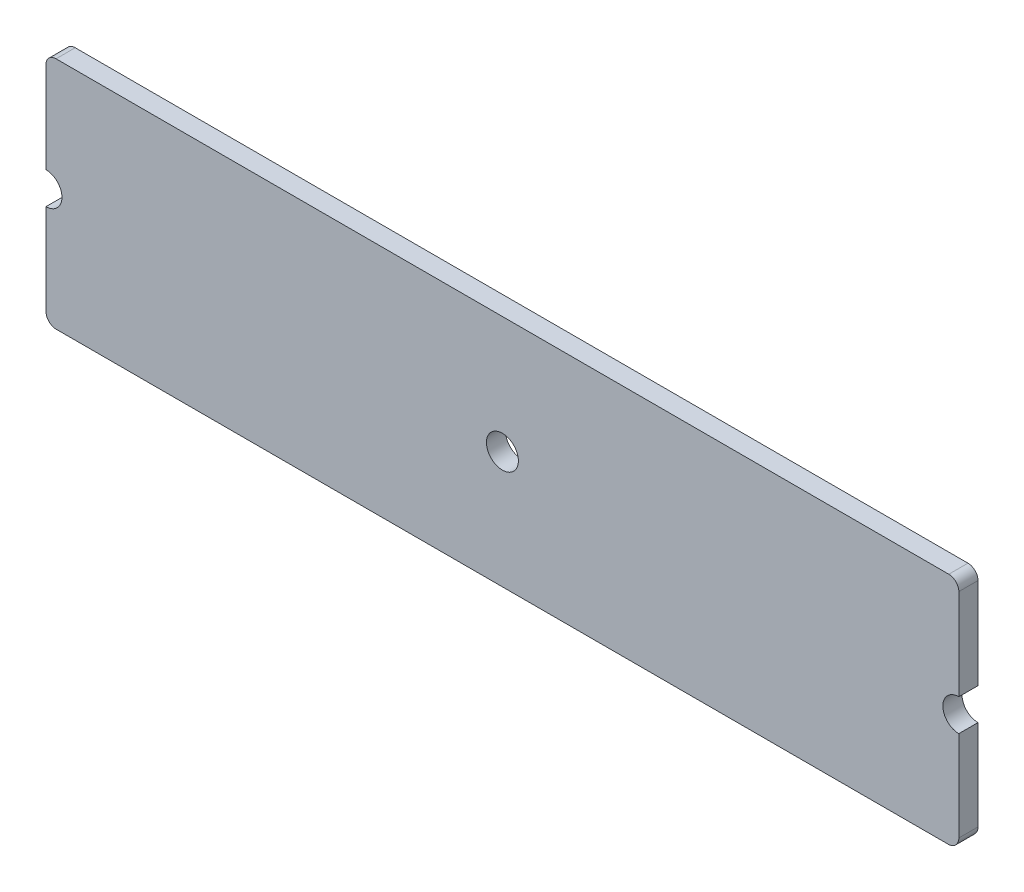
ISO-10303-21;
HEADER;
FILE_DESCRIPTION(('STEP AP214'),'2;1');
FILE_NAME('part.step','',(''),(''),'','','');
FILE_SCHEMA(('AUTOMOTIVE_DESIGN { 1 0 10303 214 1 1 1 1 }'));
ENDSEC;
DATA;
#1=APPLICATION_CONTEXT('core data for automotive mechanical design processes');
#2=APPLICATION_PROTOCOL_DEFINITION('international standard','automotive_design',2000,#1);
#3=PRODUCT_CONTEXT('',#1,'mechanical');
#4=PRODUCT('Part','Part','',(#3));
#5=PRODUCT_RELATED_PRODUCT_CATEGORY('part','',(#4));
#6=PRODUCT_DEFINITION_FORMATION('','',#4);
#7=PRODUCT_DEFINITION_CONTEXT('part definition',#1,'design');
#8=PRODUCT_DEFINITION('design','',#6,#7);
#9=PRODUCT_DEFINITION_SHAPE('','',#8);
#10=(LENGTH_UNIT() NAMED_UNIT(*) SI_UNIT(.MILLI.,.METRE.));
#11=(NAMED_UNIT(*) PLANE_ANGLE_UNIT() SI_UNIT($,.RADIAN.));
#12=(NAMED_UNIT(*) SI_UNIT($,.STERADIAN.) SOLID_ANGLE_UNIT());
#13=UNCERTAINTY_MEASURE_WITH_UNIT(LENGTH_MEASURE(1.E-05),#10,'distance_accuracy_value','');
#14=(GEOMETRIC_REPRESENTATION_CONTEXT(3) GLOBAL_UNCERTAINTY_ASSIGNED_CONTEXT((#13)) GLOBAL_UNIT_ASSIGNED_CONTEXT((#10,
#11,#12)) REPRESENTATION_CONTEXT('',''));
#15=CARTESIAN_POINT('',(0.,0.,0.));
#16=DIRECTION('',(0.,0.,1.));
#17=DIRECTION('',(1.,0.,0.));
#18=AXIS2_PLACEMENT_3D('',#15,#16,#17);
#19=CARTESIAN_POINT('',(11.12498676843,52.2999860055684,2.1));
#20=DIRECTION('',(0.,0.,-1.));
#21=DIRECTION('',(-1.,0.,0.));
#22=AXIS2_PLACEMENT_3D('',#19,#20,#21);
#23=CYLINDRICAL_SURFACE('',#22,1.12498676850782);
#24=CARTESIAN_POINT('',(11.12498676843,52.2999860055684,0.));
#25=DIRECTION('',(0.,0.,-1.));
#26=DIRECTION('',(-1.,0.,0.));
#27=AXIS2_PLACEMENT_3D('',#24,#25,#26);
#28=CIRCLE('',#27,1.12498676850782);
#29=CARTESIAN_POINT('',(11.12498676843,51.1749992370605,0.));
#30=VERTEX_POINT('',#29);
#31=CARTESIAN_POINT('',(9.99999999992218,52.2999860055684,0.));
#32=VERTEX_POINT('',#31);
#33=EDGE_CURVE('E153',#30,#32,#28,.T.);
#34=ORIENTED_EDGE('',*,*,#33,.F.);
#35=DIRECTION('',(0.,0.,-1.));
#36=VECTOR('',#35,1.);
#37=CARTESIAN_POINT('',(11.12498676843,51.1749992370605,2.1));
#38=LINE('',#37,#36);
#39=CARTESIAN_POINT('',(11.12498676843,51.1749992370605,2.1));
#40=VERTEX_POINT('',#39);
#41=EDGE_CURVE('E11',#40,#30,#38,.T.);
#42=ORIENTED_EDGE('',*,*,#41,.F.);
#43=CARTESIAN_POINT('',(11.12498676843,52.2999860055684,2.1));
#44=DIRECTION('',(0.,0.,-1.));
#45=DIRECTION('',(-1.,0.,0.));
#46=AXIS2_PLACEMENT_3D('',#43,#44,#45);
#47=CIRCLE('',#46,1.12498676850782);
#48=CARTESIAN_POINT('',(9.99999999992218,52.2999860055684,2.1));
#49=VERTEX_POINT('',#48);
#50=EDGE_CURVE('E186',#40,#49,#47,.T.);
#51=ORIENTED_EDGE('',*,*,#50,.T.);
#52=DIRECTION('',(0.,0.,-1.));
#53=VECTOR('',#52,1.);
#54=CARTESIAN_POINT('',(9.99999999992218,52.2999860055684,2.1));
#55=LINE('',#54,#53);
#56=EDGE_CURVE('E38',#49,#32,#55,.T.);
#57=ORIENTED_EDGE('',*,*,#56,.T.);
#58=EDGE_LOOP('',(#34,#42,#51,#57));
#59=FACE_BOUND('',#58,.T.);
#60=ADVANCED_FACE('F35',(#59),#23,.T.);
#61=CARTESIAN_POINT('',(108.824996948242,51.1749992370605,2.1));
#62=DIRECTION('',(0.,-1.,0.));
#63=DIRECTION('',(0.,0.,-1.));
#64=AXIS2_PLACEMENT_3D('',#61,#62,#63);
#65=PLANE('',#64);
#66=DIRECTION('',(-1.,0.,0.));
#67=VECTOR('',#66,1.);
#68=CARTESIAN_POINT('',(108.824996948242,51.1749992370605,0.));
#69=LINE('',#68,#67);
#70=CARTESIAN_POINT('',(108.824996948242,51.1749992370605,0.));
#71=VERTEX_POINT('',#70);
#72=EDGE_CURVE('E184',#71,#30,#69,.T.);
#73=ORIENTED_EDGE('',*,*,#72,.F.);
#74=DIRECTION('',(0.,0.,-1.));
#75=VECTOR('',#74,1.);
#76=CARTESIAN_POINT('',(108.824996948242,51.1749992370605,2.1));
#77=LINE('',#76,#75);
#78=CARTESIAN_POINT('',(108.824996948242,51.1749992370605,2.1));
#79=VERTEX_POINT('',#78);
#80=EDGE_CURVE('E44',#79,#71,#77,.T.);
#81=ORIENTED_EDGE('',*,*,#80,.F.);
#82=DIRECTION('',(-1.,0.,0.));
#83=VECTOR('',#82,1.);
#84=CARTESIAN_POINT('',(108.824996948242,51.1749992370605,2.1));
#85=LINE('',#84,#83);
#86=EDGE_CURVE('E148',#79,#40,#85,.T.);
#87=ORIENTED_EDGE('',*,*,#86,.T.);
#88=ORIENTED_EDGE('',*,*,#41,.T.);
#89=EDGE_LOOP('',(#73,#81,#87,#88));
#90=FACE_BOUND('',#89,.T.);
#91=ADVANCED_FACE('F208',(#90),#65,.T.);
#92=CARTESIAN_POINT('',(108.825504228001,52.3494950074185,2.1));
#93=DIRECTION('',(0.,0.,-1.));
#94=DIRECTION('',(-1.,0.,0.));
#95=AXIS2_PLACEMENT_3D('',#92,#93,#94);
#96=CYLINDRICAL_SURFACE('',#95,1.17449587990829);
#97=CARTESIAN_POINT('',(108.825504228001,52.3494950074185,0.));
#98=DIRECTION('',(0.,0.,-1.));
#99=DIRECTION('',(-1.,0.,0.));
#100=AXIS2_PLACEMENT_3D('',#97,#98,#99);
#101=CIRCLE('',#100,1.17449587990829);
#102=CARTESIAN_POINT('',(110.,52.3499984741211,0.));
#103=VERTEX_POINT('',#102);
#104=EDGE_CURVE('E144',#103,#71,#101,.T.);
#105=ORIENTED_EDGE('',*,*,#104,.F.);
#106=DIRECTION('',(0.,0.,-1.));
#107=VECTOR('',#106,1.);
#108=CARTESIAN_POINT('',(110.,52.3499984741211,2.1));
#109=LINE('',#108,#107);
#110=CARTESIAN_POINT('',(110.,52.3499984741211,2.1));
#111=VERTEX_POINT('',#110);
#112=EDGE_CURVE('E132',#111,#103,#109,.T.);
#113=ORIENTED_EDGE('',*,*,#112,.F.);
#114=CARTESIAN_POINT('',(108.825504228001,52.3494950074185,2.1));
#115=DIRECTION('',(0.,0.,-1.));
#116=DIRECTION('',(-1.,0.,0.));
#117=AXIS2_PLACEMENT_3D('',#114,#115,#116);
#118=CIRCLE('',#117,1.17449587990829);
#119=EDGE_CURVE('E139',#111,#79,#118,.T.);
#120=ORIENTED_EDGE('',*,*,#119,.T.);
#121=ORIENTED_EDGE('',*,*,#80,.T.);
#122=EDGE_LOOP('',(#105,#113,#120,#121));
#123=FACE_BOUND('',#122,.T.);
#124=ADVANCED_FACE('F142',(#123),#96,.T.);
#125=CARTESIAN_POINT('',(110.,60.9500760908949,2.1));
#126=DIRECTION('',(1.,0.,0.));
#127=DIRECTION('',(0.,1.,0.));
#128=AXIS2_PLACEMENT_3D('',#125,#126,#127);
#129=PLANE('',#128);
#130=DIRECTION('',(0.,-1.,0.));
#131=VECTOR('',#130,1.);
#132=CARTESIAN_POINT('',(110.,60.9500760908949,0.));
#133=LINE('',#132,#131);
#134=CARTESIAN_POINT('',(110.,62.2500019073486,0.));
#135=VERTEX_POINT('',#134);
#136=EDGE_CURVE('E181',#135,#103,#133,.T.);
#137=ORIENTED_EDGE('',*,*,#136,.F.);
#138=DIRECTION('',(0.,0.,-1.));
#139=VECTOR('',#138,1.);
#140=CARTESIAN_POINT('',(110.,62.2500019073486,2.1));
#141=LINE('',#140,#139);
#142=CARTESIAN_POINT('',(110.,62.2500019073486,2.1));
#143=VERTEX_POINT('',#142);
#144=EDGE_CURVE('E134',#143,#135,#141,.T.);
#145=ORIENTED_EDGE('',*,*,#144,.F.);
#146=DIRECTION('',(0.,-1.,0.));
#147=VECTOR('',#146,1.);
#148=CARTESIAN_POINT('',(110.,60.9500760908949,2.1));
#149=LINE('',#148,#147);
#150=EDGE_CURVE('E129',#143,#111,#149,.T.);
#151=ORIENTED_EDGE('',*,*,#150,.T.);
#152=ORIENTED_EDGE('',*,*,#112,.T.);
#153=EDGE_LOOP('',(#137,#145,#151,#152));
#154=FACE_BOUND('',#153,.T.);
#155=ADVANCED_FACE('F131',(#154),#129,.T.);
#156=CARTESIAN_POINT('',(110.,64.0000019073486,2.1));
#157=DIRECTION('',(0.,0.,-1.));
#158=DIRECTION('',(-1.,0.,0.));
#159=AXIS2_PLACEMENT_3D('',#156,#157,#158);
#160=CYLINDRICAL_SURFACE('',#159,1.75);
#161=CARTESIAN_POINT('',(110.,64.0000019073486,0.));
#162=DIRECTION('',(0.,0.,1.));
#163=DIRECTION('',(-1.,0.,0.));
#164=AXIS2_PLACEMENT_3D('',#161,#162,#163);
#165=CIRCLE('',#164,1.75);
#166=CARTESIAN_POINT('',(110.,65.7500019073486,0.));
#167=VERTEX_POINT('',#166);
#168=EDGE_CURVE('E178',#167,#135,#165,.T.);
#169=ORIENTED_EDGE('',*,*,#168,.F.);
#170=DIRECTION('',(0.,0.,-1.));
#171=VECTOR('',#170,1.);
#172=CARTESIAN_POINT('',(110.,65.7500019073486,2.1));
#173=LINE('',#172,#171);
#174=CARTESIAN_POINT('',(110.,65.7500019073486,2.1));
#175=VERTEX_POINT('',#174);
#176=EDGE_CURVE('E190',#175,#167,#173,.T.);
#177=ORIENTED_EDGE('',*,*,#176,.F.);
#178=CARTESIAN_POINT('',(110.,64.0000019073486,2.1));
#179=DIRECTION('',(0.,0.,1.));
#180=DIRECTION('',(-1.,0.,0.));
#181=AXIS2_PLACEMENT_3D('',#178,#179,#180);
#182=CIRCLE('',#181,1.75);
#183=EDGE_CURVE('E140',#175,#143,#182,.T.);
#184=ORIENTED_EDGE('',*,*,#183,.T.);
#185=ORIENTED_EDGE('',*,*,#144,.T.);
#186=EDGE_LOOP('',(#169,#177,#184,#185));
#187=FACE_BOUND('',#186,.T.);
#188=ADVANCED_FACE('F221',(#187),#160,.F.);
#189=CARTESIAN_POINT('',(110.,67.0499277238024,2.1));
#190=DIRECTION('',(1.,0.,0.));
#191=DIRECTION('',(0.,1.,0.));
#192=AXIS2_PLACEMENT_3D('',#189,#190,#191);
#193=PLANE('',#192);
#194=DIRECTION('',(0.,-1.,0.));
#195=VECTOR('',#194,1.);
#196=CARTESIAN_POINT('',(110.,67.0499277238024,0.));
#197=LINE('',#196,#195);
#198=CARTESIAN_POINT('',(110.,75.7249984741211,0.));
#199=VERTEX_POINT('',#198);
#200=EDGE_CURVE('E175',#199,#167,#197,.T.);
#201=ORIENTED_EDGE('',*,*,#200,.F.);
#202=DIRECTION('',(0.,0.,-1.));
#203=VECTOR('',#202,1.);
#204=CARTESIAN_POINT('',(110.,75.7249984741211,2.1));
#205=LINE('',#204,#203);
#206=CARTESIAN_POINT('',(110.,75.7249984741211,2.1));
#207=VERTEX_POINT('',#206);
#208=EDGE_CURVE('E192',#207,#199,#205,.T.);
#209=ORIENTED_EDGE('',*,*,#208,.F.);
#210=DIRECTION('',(0.,-1.,0.));
#211=VECTOR('',#210,1.);
#212=CARTESIAN_POINT('',(110.,75.7249984741211,2.1));
#213=LINE('',#212,#211);
#214=EDGE_CURVE('E290',#207,#175,#213,.T.);
#215=ORIENTED_EDGE('',*,*,#214,.T.);
#216=ORIENTED_EDGE('',*,*,#176,.T.);
#217=EDGE_LOOP('',(#201,#209,#215,#216));
#218=FACE_BOUND('',#217,.T.);
#219=ADVANCED_FACE('F224',(#218),#193,.T.);
#220=CARTESIAN_POINT('',(108.900627595444,75.7256245436864,2.1));
#221=DIRECTION('',(0.,0.,-1.));
#222=DIRECTION('',(-1.,0.,0.));
#223=AXIS2_PLACEMENT_3D('',#220,#221,#222);
#224=CYLINDRICAL_SURFACE('',#223,1.09937258282253);
#225=CARTESIAN_POINT('',(108.900627595444,75.7256245436864,0.));
#226=DIRECTION('',(0.,0.,-1.));
#227=DIRECTION('',(-1.,0.,0.));
#228=AXIS2_PLACEMENT_3D('',#225,#226,#227);
#229=CIRCLE('',#228,1.09937258282253);
#230=CARTESIAN_POINT('',(108.900001525879,76.8249969482422,0.));
#231=VERTEX_POINT('',#230);
#232=EDGE_CURVE('E172',#231,#199,#229,.T.);
#233=ORIENTED_EDGE('',*,*,#232,.F.);
#234=DIRECTION('',(0.,0.,-1.));
#235=VECTOR('',#234,1.);
#236=CARTESIAN_POINT('',(108.900001525879,76.8249969482422,2.1));
#237=LINE('',#236,#235);
#238=CARTESIAN_POINT('',(108.900001525879,76.8249969482422,2.1));
#239=VERTEX_POINT('',#238);
#240=EDGE_CURVE('E195',#239,#231,#237,.T.);
#241=ORIENTED_EDGE('',*,*,#240,.F.);
#242=CARTESIAN_POINT('',(108.900627595444,75.7256245436864,2.1));
#243=DIRECTION('',(0.,0.,-1.));
#244=DIRECTION('',(-1.,0.,0.));
#245=AXIS2_PLACEMENT_3D('',#242,#243,#244);
#246=CIRCLE('',#245,1.09937258282253);
#247=EDGE_CURVE('E287',#239,#207,#246,.T.);
#248=ORIENTED_EDGE('',*,*,#247,.T.);
#249=ORIENTED_EDGE('',*,*,#208,.T.);
#250=EDGE_LOOP('',(#233,#241,#248,#249));
#251=FACE_BOUND('',#250,.T.);
#252=ADVANCED_FACE('F228',(#251),#224,.T.);
#253=CARTESIAN_POINT('',(11.1000003814697,76.8249969482422,2.1));
#254=DIRECTION('',(0.,1.,0.));
#255=DIRECTION('',(0.,0.,1.));
#256=AXIS2_PLACEMENT_3D('',#253,#254,#255);
#257=PLANE('',#256);
#258=DIRECTION('',(1.,0.,0.));
#259=VECTOR('',#258,1.);
#260=CARTESIAN_POINT('',(11.1000003814697,76.8249969482422,0.));
#261=LINE('',#260,#259);
#262=CARTESIAN_POINT('',(11.1000003814697,76.8249969482422,0.));
#263=VERTEX_POINT('',#262);
#264=EDGE_CURVE('E169',#263,#231,#261,.T.);
#265=ORIENTED_EDGE('',*,*,#264,.F.);
#266=DIRECTION('',(0.,0.,-1.));
#267=VECTOR('',#266,1.);
#268=CARTESIAN_POINT('',(11.1000003814697,76.8249969482422,2.1));
#269=LINE('',#268,#267);
#270=CARTESIAN_POINT('',(11.1000003814697,76.8249969482422,2.1));
#271=VERTEX_POINT('',#270);
#272=EDGE_CURVE('E197',#271,#263,#269,.T.);
#273=ORIENTED_EDGE('',*,*,#272,.F.);
#274=DIRECTION('',(1.,0.,0.));
#275=VECTOR('',#274,1.);
#276=CARTESIAN_POINT('',(11.1000003814697,76.8249969482422,2.1));
#277=LINE('',#276,#275);
#278=EDGE_CURVE('E284',#271,#239,#277,.T.);
#279=ORIENTED_EDGE('',*,*,#278,.T.);
#280=ORIENTED_EDGE('',*,*,#240,.T.);
#281=EDGE_LOOP('',(#265,#273,#279,#280));
#282=FACE_BOUND('',#281,.T.);
#283=ADVANCED_FACE('F232',(#282),#257,.T.);
#284=CARTESIAN_POINT('',(11.0993740321186,75.7256229171303,2.1));
#285=DIRECTION('',(0.,0.,-1.));
#286=DIRECTION('',(-1.,0.,0.));
#287=AXIS2_PLACEMENT_3D('',#284,#285,#286);
#288=CYLINDRICAL_SURFACE('',#287,1.09937420953775);
#289=CARTESIAN_POINT('',(11.0993740321186,75.7256229171303,0.));
#290=DIRECTION('',(0.,0.,-1.));
#291=DIRECTION('',(-1.,0.,0.));
#292=AXIS2_PLACEMENT_3D('',#289,#290,#291);
#293=CIRCLE('',#292,1.09937420953775);
#294=CARTESIAN_POINT('',(9.99999999992221,75.7249984741989,0.));
#295=VERTEX_POINT('',#294);
#296=EDGE_CURVE('E166',#295,#263,#293,.T.);
#297=ORIENTED_EDGE('',*,*,#296,.F.);
#298=DIRECTION('',(0.,0.,-1.));
#299=VECTOR('',#298,1.);
#300=CARTESIAN_POINT('',(9.99999999992221,75.7249984741989,2.1));
#301=LINE('',#300,#299);
#302=CARTESIAN_POINT('',(9.99999999992221,75.7249984741989,2.1));
#303=VERTEX_POINT('',#302);
#304=EDGE_CURVE('E199',#303,#295,#301,.T.);
#305=ORIENTED_EDGE('',*,*,#304,.F.);
#306=CARTESIAN_POINT('',(11.0993740321186,75.7256229171303,2.1));
#307=DIRECTION('',(0.,0.,-1.));
#308=DIRECTION('',(-1.,0.,0.));
#309=AXIS2_PLACEMENT_3D('',#306,#307,#308);
#310=CIRCLE('',#309,1.09937420953775);
#311=EDGE_CURVE('E281',#303,#271,#310,.T.);
#312=ORIENTED_EDGE('',*,*,#311,.T.);
#313=ORIENTED_EDGE('',*,*,#272,.T.);
#314=EDGE_LOOP('',(#297,#305,#312,#313));
#315=FACE_BOUND('',#314,.T.);
#316=ADVANCED_FACE('F236',(#315),#288,.T.);
#317=CARTESIAN_POINT('',(9.99999999992218,67.0501046683345,2.1));
#318=DIRECTION('',(-1.,0.,0.));
#319=DIRECTION('',(0.,-1.,0.));
#320=AXIS2_PLACEMENT_3D('',#317,#318,#319);
#321=PLANE('',#320);
#322=DIRECTION('',(0.,1.,0.));
#323=VECTOR('',#322,1.);
#324=CARTESIAN_POINT('',(9.99999999992218,67.0501046683345,0.));
#325=LINE('',#324,#323);
#326=CARTESIAN_POINT('',(9.99999999992218,65.7500019074265,0.));
#327=VERTEX_POINT('',#326);
#328=EDGE_CURVE('E163',#327,#295,#325,.T.);
#329=ORIENTED_EDGE('',*,*,#328,.F.);
#330=DIRECTION('',(0.,0.,-1.));
#331=VECTOR('',#330,1.);
#332=CARTESIAN_POINT('',(9.99999999992218,65.7500019074265,2.1));
#333=LINE('',#332,#331);
#334=CARTESIAN_POINT('',(9.99999999992218,65.7500019074265,2.1));
#335=VERTEX_POINT('',#334);
#336=EDGE_CURVE('E201',#335,#327,#333,.T.);
#337=ORIENTED_EDGE('',*,*,#336,.F.);
#338=DIRECTION('',(0.,1.,0.));
#339=VECTOR('',#338,1.);
#340=CARTESIAN_POINT('',(9.99999999992218,67.0501046683345,2.1));
#341=LINE('',#340,#339);
#342=EDGE_CURVE('E279',#335,#303,#341,.T.);
#343=ORIENTED_EDGE('',*,*,#342,.T.);
#344=ORIENTED_EDGE('',*,*,#304,.T.);
#345=EDGE_LOOP('',(#329,#337,#343,#344));
#346=FACE_BOUND('',#345,.T.);
#347=ADVANCED_FACE('F240',(#346),#321,.T.);
#348=CARTESIAN_POINT('',(9.99999999992218,64.0000019074265,2.1));
#349=DIRECTION('',(0.,0.,-1.));
#350=DIRECTION('',(-1.,0.,0.));
#351=AXIS2_PLACEMENT_3D('',#348,#349,#350);
#352=CYLINDRICAL_SURFACE('',#351,1.75);
#353=CARTESIAN_POINT('',(9.99999999992218,64.0000019074265,0.));
#354=DIRECTION('',(0.,0.,1.));
#355=DIRECTION('',(-1.,0.,0.));
#356=AXIS2_PLACEMENT_3D('',#353,#354,#355);
#357=CIRCLE('',#356,1.75);
#358=CARTESIAN_POINT('',(9.99999999992218,62.2500019074265,0.));
#359=VERTEX_POINT('',#358);
#360=EDGE_CURVE('E160',#359,#327,#357,.T.);
#361=ORIENTED_EDGE('',*,*,#360,.F.);
#362=DIRECTION('',(0.,0.,-1.));
#363=VECTOR('',#362,1.);
#364=CARTESIAN_POINT('',(9.99999999992218,62.2500019074265,2.1));
#365=LINE('',#364,#363);
#366=CARTESIAN_POINT('',(9.99999999992218,62.2500019074265,2.1));
#367=VERTEX_POINT('',#366);
#368=EDGE_CURVE('E203',#367,#359,#365,.T.);
#369=ORIENTED_EDGE('',*,*,#368,.F.);
#370=CARTESIAN_POINT('',(9.99999999992218,64.0000019074265,2.1));
#371=DIRECTION('',(0.,0.,1.));
#372=DIRECTION('',(-1.,0.,0.));
#373=AXIS2_PLACEMENT_3D('',#370,#371,#372);
#374=CIRCLE('',#373,1.75);
#375=EDGE_CURVE('E276',#367,#335,#374,.T.);
#376=ORIENTED_EDGE('',*,*,#375,.T.);
#377=ORIENTED_EDGE('',*,*,#336,.T.);
#378=EDGE_LOOP('',(#361,#369,#376,#377));
#379=FACE_BOUND('',#378,.T.);
#380=ADVANCED_FACE('F244',(#379),#352,.F.);
#381=CARTESIAN_POINT('',(9.99999999992218,62.2500019074265,2.1));
#382=DIRECTION('',(-1.,0.,0.));
#383=DIRECTION('',(0.,0.,1.));
#384=AXIS2_PLACEMENT_3D('',#381,#382,#383);
#385=PLANE('',#384);
#386=DIRECTION('',(0.,1.,0.));
#387=VECTOR('',#386,1.);
#388=CARTESIAN_POINT('',(9.99999999992218,62.2500019074265,0.));
#389=LINE('',#388,#387);
#390=EDGE_CURVE('E156',#32,#359,#389,.T.);
#391=ORIENTED_EDGE('',*,*,#390,.F.);
#392=ORIENTED_EDGE('',*,*,#56,.F.);
#393=DIRECTION('',(0.,1.,0.));
#394=VECTOR('',#393,1.);
#395=CARTESIAN_POINT('',(9.99999999992218,52.2999860055684,2.1));
#396=LINE('',#395,#394);
#397=EDGE_CURVE('E274',#49,#367,#396,.T.);
#398=ORIENTED_EDGE('',*,*,#397,.T.);
#399=ORIENTED_EDGE('',*,*,#368,.T.);
#400=EDGE_LOOP('',(#391,#392,#398,#399));
#401=FACE_BOUND('',#400,.T.);
#402=ADVANCED_FACE('F247',(#401),#385,.T.);
#403=CARTESIAN_POINT('',(11.12498676843,52.2999860055684,2.1));
#404=DIRECTION('',(0.,0.,-1.));
#405=DIRECTION('',(-1.,0.,0.));
#406=AXIS2_PLACEMENT_3D('',#403,#404,#405);
#407=PLANE('',#406);
#408=CARTESIAN_POINT('',(59.99999938,63.999999,2.1));
#409=DIRECTION('',(0.,0.,-1.));
#410=DIRECTION('',(1.,0.,0.));
#411=AXIS2_PLACEMENT_3D('',#408,#409,#410);
#412=CIRCLE('',#411,1.74999904);
#413=CARTESIAN_POINT('',(61.74999842,63.999999,2.1));
#414=VERTEX_POINT('',#413);
#415=EDGE_CURVE('E157',#414,#414,#412,.T.);
#416=ORIENTED_EDGE('',*,*,#415,.T.);
#417=EDGE_LOOP('',(#416));
#418=FACE_BOUND('',#417,.T.);
#419=ORIENTED_EDGE('',*,*,#50,.F.);
#420=ORIENTED_EDGE('',*,*,#86,.F.);
#421=ORIENTED_EDGE('',*,*,#119,.F.);
#422=ORIENTED_EDGE('',*,*,#150,.F.);
#423=ORIENTED_EDGE('',*,*,#183,.F.);
#424=ORIENTED_EDGE('',*,*,#214,.F.);
#425=ORIENTED_EDGE('',*,*,#247,.F.);
#426=ORIENTED_EDGE('',*,*,#278,.F.);
#427=ORIENTED_EDGE('',*,*,#311,.F.);
#428=ORIENTED_EDGE('',*,*,#342,.F.);
#429=ORIENTED_EDGE('',*,*,#375,.F.);
#430=ORIENTED_EDGE('',*,*,#397,.F.);
#431=EDGE_LOOP('',(#419,#420,#421,#422,#423,#424,#425,#426,#427,#428,#429,#430));
#432=FACE_BOUND('',#431,.T.);
#433=ADVANCED_FACE('F147',(#418,#432),#407,.F.);
#434=CARTESIAN_POINT('',(11.12498676843,52.2999860055684,0.));
#435=DIRECTION('',(0.,0.,-1.));
#436=DIRECTION('',(-1.,0.,0.));
#437=AXIS2_PLACEMENT_3D('',#434,#435,#436);
#438=PLANE('',#437);
#439=CARTESIAN_POINT('',(59.99999938,63.999999,0.));
#440=DIRECTION('',(0.,0.,-1.));
#441=DIRECTION('',(1.,0.,0.));
#442=AXIS2_PLACEMENT_3D('',#439,#440,#441);
#443=CIRCLE('',#442,1.74999904);
#444=CARTESIAN_POINT('',(61.74999842,63.999999,0.));
#445=VERTEX_POINT('',#444);
#446=EDGE_CURVE('E269',#445,#445,#443,.T.);
#447=ORIENTED_EDGE('',*,*,#446,.F.);
#448=EDGE_LOOP('',(#447));
#449=FACE_BOUND('',#448,.T.);
#450=ORIENTED_EDGE('',*,*,#33,.T.);
#451=ORIENTED_EDGE('',*,*,#390,.T.);
#452=ORIENTED_EDGE('',*,*,#360,.T.);
#453=ORIENTED_EDGE('',*,*,#328,.T.);
#454=ORIENTED_EDGE('',*,*,#296,.T.);
#455=ORIENTED_EDGE('',*,*,#264,.T.);
#456=ORIENTED_EDGE('',*,*,#232,.T.);
#457=ORIENTED_EDGE('',*,*,#200,.T.);
#458=ORIENTED_EDGE('',*,*,#168,.T.);
#459=ORIENTED_EDGE('',*,*,#136,.T.);
#460=ORIENTED_EDGE('',*,*,#104,.T.);
#461=ORIENTED_EDGE('',*,*,#72,.T.);
#462=EDGE_LOOP('',(#450,#451,#452,#453,#454,#455,#456,#457,#458,#459,#460,#461));
#463=FACE_BOUND('',#462,.T.);
#464=ADVANCED_FACE('F207',(#449,#463),#438,.T.);
#465=CARTESIAN_POINT('',(59.99999938,63.999999,2.1));
#466=DIRECTION('',(0.,0.,-1.));
#467=DIRECTION('',(-1.,0.,0.));
#468=AXIS2_PLACEMENT_3D('',#465,#466,#467);
#469=CYLINDRICAL_SURFACE('',#468,1.74999904);
#470=ORIENTED_EDGE('',*,*,#415,.F.);
#471=EDGE_LOOP('',(#470));
#472=FACE_BOUND('',#471,.T.);
#473=ORIENTED_EDGE('',*,*,#446,.T.);
#474=EDGE_LOOP('',(#473));
#475=FACE_BOUND('',#474,.T.);
#476=ADVANCED_FACE('F257',(#472,#475),#469,.F.);
#477=CLOSED_SHELL('',(#60,#91,#124,#155,#188,#219,#252,#283,#316,#347,#380,#402,#433,#464,#476));
#478=MANIFOLD_SOLID_BREP('B2',#477);
#479=ADVANCED_BREP_SHAPE_REPRESENTATION('',(#18,#478),#14);
#480=SHAPE_DEFINITION_REPRESENTATION(#9,#479);
ENDSEC;
END-ISO-10303-21;
